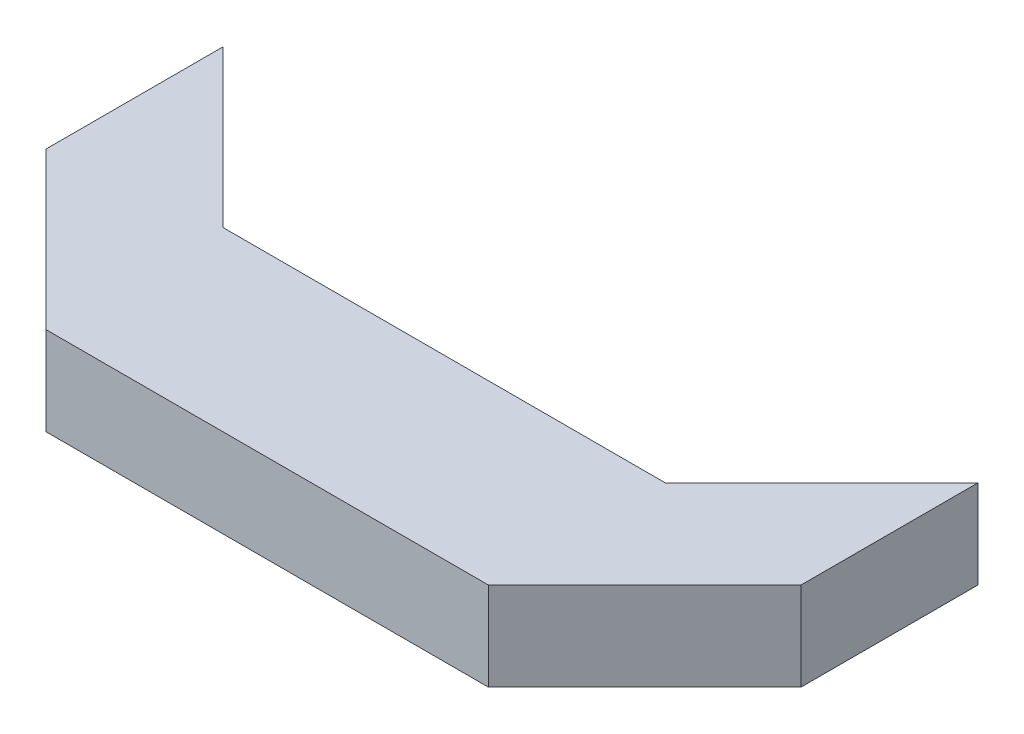
ISO-10303-21;
HEADER;
FILE_DESCRIPTION(('STEP AP214'),'2;1');
FILE_NAME('part.step','',(''),(''),'','','');
FILE_SCHEMA(('AUTOMOTIVE_DESIGN { 1 0 10303 214 1 1 1 1 }'));
ENDSEC;
DATA;
#1=APPLICATION_CONTEXT('core data for automotive mechanical design processes');
#2=APPLICATION_PROTOCOL_DEFINITION('international standard','automotive_design',2000,#1);
#3=PRODUCT_CONTEXT('',#1,'mechanical');
#4=PRODUCT('Part','Part','',(#3));
#5=PRODUCT_RELATED_PRODUCT_CATEGORY('part','',(#4));
#6=PRODUCT_DEFINITION_FORMATION('','',#4);
#7=PRODUCT_DEFINITION_CONTEXT('part definition',#1,'design');
#8=PRODUCT_DEFINITION('design','',#6,#7);
#9=PRODUCT_DEFINITION_SHAPE('','',#8);
#10=(LENGTH_UNIT() NAMED_UNIT(*) SI_UNIT(.MILLI.,.METRE.));
#11=(NAMED_UNIT(*) PLANE_ANGLE_UNIT() SI_UNIT($,.RADIAN.));
#12=(NAMED_UNIT(*) SI_UNIT($,.STERADIAN.) SOLID_ANGLE_UNIT());
#13=UNCERTAINTY_MEASURE_WITH_UNIT(LENGTH_MEASURE(1.E-05),#10,'distance_accuracy_value','');
#14=(GEOMETRIC_REPRESENTATION_CONTEXT(3) GLOBAL_UNCERTAINTY_ASSIGNED_CONTEXT((#13)) GLOBAL_UNIT_ASSIGNED_CONTEXT((#10,
#11,#12)) REPRESENTATION_CONTEXT('',''));
#15=CARTESIAN_POINT('',(0.,0.,0.));
#16=DIRECTION('',(0.,0.,1.));
#17=DIRECTION('',(1.,0.,0.));
#18=AXIS2_PLACEMENT_3D('',#15,#16,#17);
#19=CARTESIAN_POINT('',(85.3553390593273,20.,-15.3553390593269));
#20=DIRECTION('',(-0.707106781186544,0.,-0.707106781186551));
#21=DIRECTION('',(-0.707106781186551,0.,0.707106781186544));
#22=AXIS2_PLACEMENT_3D('',#19,#20,#21);
#23=PLANE('',#22);
#24=DIRECTION('',(0.707106781186551,0.,-0.707106781186544));
#25=VECTOR('',#24,1.);
#26=CARTESIAN_POINT('',(85.3553390593273,0.,-15.3553390593269));
#27=LINE('',#26,#25);
#28=CARTESIAN_POINT('',(50.,0.,20.));
#29=VERTEX_POINT('',#28);
#30=CARTESIAN_POINT('',(85.3553390593273,0.,-15.3553390593269));
#31=VERTEX_POINT('',#30);
#32=EDGE_CURVE('E140',#29,#31,#27,.T.);
#33=ORIENTED_EDGE('',*,*,#32,.T.);
#34=DIRECTION('',(0.,-1.,0.));
#35=VECTOR('',#34,1.);
#36=CARTESIAN_POINT('',(85.3553390593273,20.,-15.3553390593269));
#37=LINE('',#36,#35);
#38=CARTESIAN_POINT('',(85.3553390593273,20.,-15.3553390593269));
#39=VERTEX_POINT('',#38);
#40=EDGE_CURVE('E11',#39,#31,#37,.T.);
#41=ORIENTED_EDGE('',*,*,#40,.F.);
#42=DIRECTION('',(0.707106781186551,0.,-0.707106781186544));
#43=VECTOR('',#42,1.);
#44=CARTESIAN_POINT('',(85.3553390593273,20.,-15.3553390593269));
#45=LINE('',#44,#43);
#46=CARTESIAN_POINT('',(50.,20.,20.));
#47=VERTEX_POINT('',#46);
#48=EDGE_CURVE('E162',#47,#39,#45,.T.);
#49=ORIENTED_EDGE('',*,*,#48,.F.);
#50=DIRECTION('',(0.,-1.,0.));
#51=VECTOR('',#50,1.);
#52=CARTESIAN_POINT('',(50.,20.,20.));
#53=LINE('',#52,#51);
#54=EDGE_CURVE('E136',#47,#29,#53,.T.);
#55=ORIENTED_EDGE('',*,*,#54,.T.);
#56=EDGE_LOOP('',(#33,#41,#49,#55));
#57=FACE_BOUND('',#56,.T.);
#58=ADVANCED_FACE('F39',(#57),#23,.F.);
#59=CARTESIAN_POINT('',(85.3553390593273,20.,-55.3553390593274));
#60=DIRECTION('',(-1.,0.,0.));
#61=DIRECTION('',(0.,0.,1.));
#62=AXIS2_PLACEMENT_3D('',#59,#60,#61);
#63=PLANE('',#62);
#64=DIRECTION('',(0.,0.,-1.));
#65=VECTOR('',#64,1.);
#66=CARTESIAN_POINT('',(85.3553390593273,0.,-55.3553390593274));
#67=LINE('',#66,#65);
#68=CARTESIAN_POINT('',(85.3553390593273,0.,-55.3553390593274));
#69=VERTEX_POINT('',#68);
#70=EDGE_CURVE('E144',#31,#69,#67,.T.);
#71=ORIENTED_EDGE('',*,*,#70,.T.);
#72=DIRECTION('',(0.,-1.,0.));
#73=VECTOR('',#72,1.);
#74=CARTESIAN_POINT('',(85.3553390593273,20.,-55.3553390593274));
#75=LINE('',#74,#73);
#76=CARTESIAN_POINT('',(85.3553390593273,20.,-55.3553390593274));
#77=VERTEX_POINT('',#76);
#78=EDGE_CURVE('E48',#77,#69,#75,.T.);
#79=ORIENTED_EDGE('',*,*,#78,.F.);
#80=DIRECTION('',(0.,0.,-1.));
#81=VECTOR('',#80,1.);
#82=CARTESIAN_POINT('',(85.3553390593273,20.,-55.3553390593274));
#83=LINE('',#82,#81);
#84=EDGE_CURVE('E99',#39,#77,#83,.T.);
#85=ORIENTED_EDGE('',*,*,#84,.F.);
#86=ORIENTED_EDGE('',*,*,#40,.T.);
#87=EDGE_LOOP('',(#71,#79,#85,#86));
#88=FACE_BOUND('',#87,.T.);
#89=ADVANCED_FACE('F208',(#88),#63,.F.);
#90=CARTESIAN_POINT('',(50.,20.,-20.));
#91=DIRECTION('',(0.707106781186549,0.,0.707106781186546));
#92=DIRECTION('',(0.707106781186546,0.,-0.707106781186549));
#93=AXIS2_PLACEMENT_3D('',#90,#91,#92);
#94=PLANE('',#93);
#95=DIRECTION('',(-0.707106781186546,0.,0.707106781186549));
#96=VECTOR('',#95,1.);
#97=CARTESIAN_POINT('',(50.,0.,-20.));
#98=LINE('',#97,#96);
#99=CARTESIAN_POINT('',(50.,0.,-20.));
#100=VERTEX_POINT('',#99);
#101=EDGE_CURVE('E147',#69,#100,#98,.T.);
#102=ORIENTED_EDGE('',*,*,#101,.T.);
#103=DIRECTION('',(0.,-1.,0.));
#104=VECTOR('',#103,1.);
#105=CARTESIAN_POINT('',(50.,20.,-20.));
#106=LINE('',#105,#104);
#107=CARTESIAN_POINT('',(50.,20.,-20.));
#108=VERTEX_POINT('',#107);
#109=EDGE_CURVE('E173',#108,#100,#106,.T.);
#110=ORIENTED_EDGE('',*,*,#109,.F.);
#111=DIRECTION('',(-0.707106781186546,0.,0.707106781186549));
#112=VECTOR('',#111,1.);
#113=CARTESIAN_POINT('',(50.,20.,-20.));
#114=LINE('',#113,#112);
#115=EDGE_CURVE('E183',#77,#108,#114,.T.);
#116=ORIENTED_EDGE('',*,*,#115,.F.);
#117=ORIENTED_EDGE('',*,*,#78,.T.);
#118=EDGE_LOOP('',(#102,#110,#116,#117));
#119=FACE_BOUND('',#118,.T.);
#120=ADVANCED_FACE('F181',(#119),#94,.F.);
#121=CARTESIAN_POINT('',(-50.,20.,-20.));
#122=DIRECTION('',(0.,0.,1.));
#123=DIRECTION('',(1.,0.,0.));
#124=AXIS2_PLACEMENT_3D('',#121,#122,#123);
#125=PLANE('',#124);
#126=DIRECTION('',(-1.,0.,0.));
#127=VECTOR('',#126,1.);
#128=CARTESIAN_POINT('',(-50.,0.,-20.));
#129=LINE('',#128,#127);
#130=CARTESIAN_POINT('',(-50.,0.,-20.));
#131=VERTEX_POINT('',#130);
#132=EDGE_CURVE('E150',#100,#131,#129,.T.);
#133=ORIENTED_EDGE('',*,*,#132,.T.);
#134=DIRECTION('',(0.,-1.,0.));
#135=VECTOR('',#134,1.);
#136=CARTESIAN_POINT('',(-50.,20.,-20.));
#137=LINE('',#136,#135);
#138=CARTESIAN_POINT('',(-50.,20.,-20.));
#139=VERTEX_POINT('',#138);
#140=EDGE_CURVE('E169',#139,#131,#137,.T.);
#141=ORIENTED_EDGE('',*,*,#140,.F.);
#142=DIRECTION('',(-1.,0.,0.));
#143=VECTOR('',#142,1.);
#144=CARTESIAN_POINT('',(-50.,20.,-20.));
#145=LINE('',#144,#143);
#146=EDGE_CURVE('E196',#108,#139,#145,.T.);
#147=ORIENTED_EDGE('',*,*,#146,.F.);
#148=ORIENTED_EDGE('',*,*,#109,.T.);
#149=EDGE_LOOP('',(#133,#141,#147,#148));
#150=FACE_BOUND('',#149,.T.);
#151=ADVANCED_FACE('F191',(#150),#125,.F.);
#152=CARTESIAN_POINT('',(-50.,20.,-20.));
#153=DIRECTION('',(-0.707106781186544,0.,0.707106781186551));
#154=DIRECTION('',(0.707106781186551,0.,0.707106781186544));
#155=AXIS2_PLACEMENT_3D('',#152,#153,#154);
#156=PLANE('',#155);
#157=DIRECTION('',(-0.707106781186551,0.,-0.707106781186544));
#158=VECTOR('',#157,1.);
#159=CARTESIAN_POINT('',(-50.,0.,-20.));
#160=LINE('',#159,#158);
#161=CARTESIAN_POINT('',(-85.3553390593276,0.,-55.3553390593272));
#162=VERTEX_POINT('',#161);
#163=EDGE_CURVE('E153',#131,#162,#160,.T.);
#164=ORIENTED_EDGE('',*,*,#163,.T.);
#165=DIRECTION('',(0.,-1.,0.));
#166=VECTOR('',#165,1.);
#167=CARTESIAN_POINT('',(-85.3553390593276,20.,-55.3553390593272));
#168=LINE('',#167,#166);
#169=CARTESIAN_POINT('',(-85.3553390593276,20.,-55.3553390593272));
#170=VERTEX_POINT('',#169);
#171=EDGE_CURVE('E129',#170,#162,#168,.T.);
#172=ORIENTED_EDGE('',*,*,#171,.F.);
#173=DIRECTION('',(-0.707106781186551,0.,-0.707106781186544));
#174=VECTOR('',#173,1.);
#175=CARTESIAN_POINT('',(-50.,20.,-20.));
#176=LINE('',#175,#174);
#177=EDGE_CURVE('E118',#139,#170,#176,.T.);
#178=ORIENTED_EDGE('',*,*,#177,.F.);
#179=ORIENTED_EDGE('',*,*,#140,.T.);
#180=EDGE_LOOP('',(#164,#172,#178,#179));
#181=FACE_BOUND('',#180,.T.);
#182=ADVANCED_FACE('F194',(#181),#156,.F.);
#183=CARTESIAN_POINT('',(-85.3553390593276,20.,-55.3553390593272));
#184=DIRECTION('',(1.,0.,0.));
#185=DIRECTION('',(0.,0.,-1.));
#186=AXIS2_PLACEMENT_3D('',#183,#184,#185);
#187=PLANE('',#186);
#188=DIRECTION('',(0.,0.,1.));
#189=VECTOR('',#188,1.);
#190=CARTESIAN_POINT('',(-85.3553390593276,0.,-55.3553390593272));
#191=LINE('',#190,#189);
#192=CARTESIAN_POINT('',(-85.3553390593276,0.,-15.3553390593277));
#193=VERTEX_POINT('',#192);
#194=EDGE_CURVE('E127',#162,#193,#191,.T.);
#195=ORIENTED_EDGE('',*,*,#194,.T.);
#196=DIRECTION('',(0.,-1.,0.));
#197=VECTOR('',#196,1.);
#198=CARTESIAN_POINT('',(-85.3553390593276,20.,-15.3553390593277));
#199=LINE('',#198,#197);
#200=CARTESIAN_POINT('',(-85.3553390593276,20.,-15.3553390593277));
#201=VERTEX_POINT('',#200);
#202=EDGE_CURVE('E124',#201,#193,#199,.T.);
#203=ORIENTED_EDGE('',*,*,#202,.F.);
#204=DIRECTION('',(0.,0.,1.));
#205=VECTOR('',#204,1.);
#206=CARTESIAN_POINT('',(-85.3553390593276,20.,-55.3553390593272));
#207=LINE('',#206,#205);
#208=EDGE_CURVE('E112',#170,#201,#207,.T.);
#209=ORIENTED_EDGE('',*,*,#208,.F.);
#210=ORIENTED_EDGE('',*,*,#171,.T.);
#211=EDGE_LOOP('',(#195,#203,#209,#210));
#212=FACE_BOUND('',#211,.T.);
#213=ADVANCED_FACE('F125',(#212),#187,.F.);
#214=CARTESIAN_POINT('',(-85.3553390593276,20.,-15.3553390593277));
#215=DIRECTION('',(0.707106781186549,0.,-0.707106781186546));
#216=DIRECTION('',(-0.707106781186546,0.,-0.707106781186549));
#217=AXIS2_PLACEMENT_3D('',#214,#215,#216);
#218=PLANE('',#217);
#219=DIRECTION('',(0.707106781186546,0.,0.707106781186549));
#220=VECTOR('',#219,1.);
#221=CARTESIAN_POINT('',(-85.3553390593276,0.,-15.3553390593277));
#222=LINE('',#221,#220);
#223=CARTESIAN_POINT('',(-50.,0.,20.));
#224=VERTEX_POINT('',#223);
#225=EDGE_CURVE('E85',#193,#224,#222,.T.);
#226=ORIENTED_EDGE('',*,*,#225,.T.);
#227=DIRECTION('',(0.,-1.,0.));
#228=VECTOR('',#227,1.);
#229=CARTESIAN_POINT('',(-50.,20.,20.));
#230=LINE('',#229,#228);
#231=CARTESIAN_POINT('',(-50.,20.,20.));
#232=VERTEX_POINT('',#231);
#233=EDGE_CURVE('E130',#232,#224,#230,.T.);
#234=ORIENTED_EDGE('',*,*,#233,.F.);
#235=DIRECTION('',(0.707106781186546,0.,0.707106781186549));
#236=VECTOR('',#235,1.);
#237=CARTESIAN_POINT('',(-85.3553390593276,20.,-15.3553390593277));
#238=LINE('',#237,#236);
#239=EDGE_CURVE('E116',#201,#232,#238,.T.);
#240=ORIENTED_EDGE('',*,*,#239,.F.);
#241=ORIENTED_EDGE('',*,*,#202,.T.);
#242=EDGE_LOOP('',(#226,#234,#240,#241));
#243=FACE_BOUND('',#242,.T.);
#244=ADVANCED_FACE('F132',(#243),#218,.F.);
#245=CARTESIAN_POINT('',(-50.,20.,20.));
#246=DIRECTION('',(0.,0.,-1.));
#247=DIRECTION('',(-1.,0.,0.));
#248=AXIS2_PLACEMENT_3D('',#245,#246,#247);
#249=PLANE('',#248);
#250=DIRECTION('',(1.,0.,0.));
#251=VECTOR('',#250,1.);
#252=CARTESIAN_POINT('',(-50.,0.,20.));
#253=LINE('',#252,#251);
#254=EDGE_CURVE('E91',#224,#29,#253,.T.);
#255=ORIENTED_EDGE('',*,*,#254,.T.);
#256=ORIENTED_EDGE('',*,*,#54,.F.);
#257=DIRECTION('',(1.,0.,0.));
#258=VECTOR('',#257,1.);
#259=CARTESIAN_POINT('',(-50.,20.,20.));
#260=LINE('',#259,#258);
#261=EDGE_CURVE('E56',#232,#47,#260,.T.);
#262=ORIENTED_EDGE('',*,*,#261,.F.);
#263=ORIENTED_EDGE('',*,*,#233,.T.);
#264=EDGE_LOOP('',(#255,#256,#262,#263));
#265=FACE_BOUND('',#264,.T.);
#266=ADVANCED_FACE('F224',(#265),#249,.F.);
#267=CARTESIAN_POINT('',(0.,20.,0.));
#268=DIRECTION('',(0.,1.,0.));
#269=DIRECTION('',(0.,0.,1.));
#270=AXIS2_PLACEMENT_3D('',#267,#268,#269);
#271=PLANE('',#270);
#272=ORIENTED_EDGE('',*,*,#48,.T.);
#273=ORIENTED_EDGE('',*,*,#84,.T.);
#274=ORIENTED_EDGE('',*,*,#115,.T.);
#275=ORIENTED_EDGE('',*,*,#146,.T.);
#276=ORIENTED_EDGE('',*,*,#177,.T.);
#277=ORIENTED_EDGE('',*,*,#208,.T.);
#278=ORIENTED_EDGE('',*,*,#239,.T.);
#279=ORIENTED_EDGE('',*,*,#261,.T.);
#280=EDGE_LOOP('',(#272,#273,#274,#275,#276,#277,#278,#279));
#281=FACE_BOUND('',#280,.T.);
#282=ADVANCED_FACE('F114',(#281),#271,.T.);
#283=CARTESIAN_POINT('',(0.,0.,0.));
#284=DIRECTION('',(0.,1.,0.));
#285=DIRECTION('',(0.,0.,1.));
#286=AXIS2_PLACEMENT_3D('',#283,#284,#285);
#287=PLANE('',#286);
#288=ORIENTED_EDGE('',*,*,#32,.F.);
#289=ORIENTED_EDGE('',*,*,#254,.F.);
#290=ORIENTED_EDGE('',*,*,#225,.F.);
#291=ORIENTED_EDGE('',*,*,#194,.F.);
#292=ORIENTED_EDGE('',*,*,#163,.F.);
#293=ORIENTED_EDGE('',*,*,#132,.F.);
#294=ORIENTED_EDGE('',*,*,#101,.F.);
#295=ORIENTED_EDGE('',*,*,#70,.F.);
#296=EDGE_LOOP('',(#288,#289,#290,#291,#292,#293,#294,#295));
#297=FACE_BOUND('',#296,.T.);
#298=ADVANCED_FACE('F187',(#297),#287,.F.);
#299=CLOSED_SHELL('',(#58,#89,#120,#151,#182,#213,#244,#266,#282,#298));
#300=MANIFOLD_SOLID_BREP('B2',#299);
#301=ADVANCED_BREP_SHAPE_REPRESENTATION('',(#18,#300),#14);
#302=SHAPE_DEFINITION_REPRESENTATION(#9,#301);
ENDSEC;
END-ISO-10303-21;
